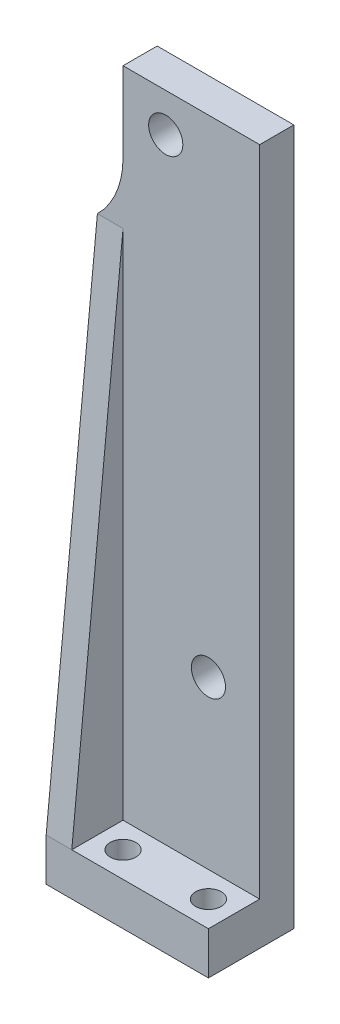
ISO-10303-21;
HEADER;
FILE_DESCRIPTION(('STEP AP214'),'2;1');
FILE_NAME('part.step','',(''),(''),'','','');
FILE_SCHEMA(('AUTOMOTIVE_DESIGN { 1 0 10303 214 1 1 1 1 }'));
ENDSEC;
DATA;
#1=APPLICATION_CONTEXT('core data for automotive mechanical design processes');
#2=APPLICATION_PROTOCOL_DEFINITION('international standard','automotive_design',2000,#1);
#3=PRODUCT_CONTEXT('',#1,'mechanical');
#4=PRODUCT('Part','Part','',(#3));
#5=PRODUCT_RELATED_PRODUCT_CATEGORY('part','',(#4));
#6=PRODUCT_DEFINITION_FORMATION('','',#4);
#7=PRODUCT_DEFINITION_CONTEXT('part definition',#1,'design');
#8=PRODUCT_DEFINITION('design','',#6,#7);
#9=PRODUCT_DEFINITION_SHAPE('','',#8);
#10=(LENGTH_UNIT() NAMED_UNIT(*) SI_UNIT(.MILLI.,.METRE.));
#11=(NAMED_UNIT(*) PLANE_ANGLE_UNIT() SI_UNIT($,.RADIAN.));
#12=(NAMED_UNIT(*) SI_UNIT($,.STERADIAN.) SOLID_ANGLE_UNIT());
#13=UNCERTAINTY_MEASURE_WITH_UNIT(LENGTH_MEASURE(1.E-05),#10,'distance_accuracy_value','');
#14=(GEOMETRIC_REPRESENTATION_CONTEXT(3) GLOBAL_UNCERTAINTY_ASSIGNED_CONTEXT((#13)) GLOBAL_UNIT_ASSIGNED_CONTEXT((#10,
#11,#12)) REPRESENTATION_CONTEXT('',''));
#15=CARTESIAN_POINT('',(0.,0.,0.));
#16=DIRECTION('',(0.,0.,1.));
#17=DIRECTION('',(1.,0.,0.));
#18=AXIS2_PLACEMENT_3D('',#15,#16,#17);
#19=CARTESIAN_POINT('',(-10.,5.,0.));
#20=DIRECTION('',(1.,0.,0.));
#21=DIRECTION('',(0.,0.,-1.));
#22=AXIS2_PLACEMENT_3D('',#19,#20,#21);
#23=PLANE('',#22);
#24=DIRECTION('',(0.,-1.,0.));
#25=VECTOR('',#24,1.);
#26=CARTESIAN_POINT('',(-9.99999999999999,81.5,-7.));
#27=LINE('',#26,#25);
#28=CARTESIAN_POINT('',(-9.99999999999999,81.5,-7.));
#29=VERTEX_POINT('',#28);
#30=CARTESIAN_POINT('',(-9.99999999999999,72.1414284285429,-7.));
#31=VERTEX_POINT('',#30);
#32=EDGE_CURVE('E157',#29,#31,#27,.T.);
#33=ORIENTED_EDGE('',*,*,#32,.T.);
#34=DIRECTION('',(0.,0.,-1.));
#35=VECTOR('',#34,1.);
#36=CARTESIAN_POINT('',(-10.,72.1414284285429,0.));
#37=LINE('',#36,#35);
#38=CARTESIAN_POINT('',(-9.99999999999999,72.1414284285429,-3.));
#39=VERTEX_POINT('',#38);
#40=EDGE_CURVE('E113',#31,#39,#37,.F.);
#41=ORIENTED_EDGE('',*,*,#40,.T.);
#42=DIRECTION('',(0.,-1.,0.));
#43=VECTOR('',#42,1.);
#44=CARTESIAN_POINT('',(-9.99999999999999,81.5,-3.));
#45=LINE('',#44,#43);
#46=CARTESIAN_POINT('',(-9.99999999999999,81.5,-3.));
#47=VERTEX_POINT('',#46);
#48=EDGE_CURVE('E151',#47,#39,#45,.T.);
#49=ORIENTED_EDGE('',*,*,#48,.F.);
#50=DIRECTION('',(0.,0.,1.));
#51=VECTOR('',#50,1.);
#52=CARTESIAN_POINT('',(-9.99999999999999,81.5,-7.));
#53=LINE('',#52,#51);
#54=EDGE_CURVE('E169',#29,#47,#53,.T.);
#55=ORIENTED_EDGE('',*,*,#54,.F.);
#56=EDGE_LOOP('',(#33,#41,#49,#55));
#57=FACE_BOUND('',#56,.T.);
#58=ADVANCED_FACE('F38',(#57),#23,.F.);
#59=CARTESIAN_POINT('',(-5.,77.,3.));
#60=DIRECTION('',(0.,0.,-1.));
#61=DIRECTION('',(-1.,0.,0.));
#62=AXIS2_PLACEMENT_3D('',#59,#60,#61);
#63=CYLINDRICAL_SURFACE('',#62,2.);
#64=CARTESIAN_POINT('',(-5.,77.,-3.));
#65=DIRECTION('',(0.,0.,1.));
#66=DIRECTION('',(1.,0.,0.));
#67=AXIS2_PLACEMENT_3D('',#64,#65,#66);
#68=CIRCLE('',#67,2.);
#69=CARTESIAN_POINT('',(-3.,77.,-3.));
#70=VERTEX_POINT('',#69);
#71=EDGE_CURVE('E163',#70,#70,#68,.T.);
#72=ORIENTED_EDGE('',*,*,#71,.T.);
#73=EDGE_LOOP('',(#72));
#74=FACE_BOUND('',#73,.T.);
#75=CARTESIAN_POINT('',(-5.,77.,-6.));
#76=DIRECTION('',(0.,0.,-1.));
#77=DIRECTION('',(-1.,0.,0.));
#78=AXIS2_PLACEMENT_3D('',#75,#76,#77);
#79=CIRCLE('',#78,2.);
#80=CARTESIAN_POINT('',(-7.,77.,-6.));
#81=VERTEX_POINT('',#80);
#82=EDGE_CURVE('E142',#81,#81,#79,.F.);
#83=ORIENTED_EDGE('',*,*,#82,.F.);
#84=EDGE_LOOP('',(#83));
#85=FACE_BOUND('',#84,.T.);
#86=ADVANCED_FACE('F238',(#74,#85),#63,.F.);
#87=CARTESIAN_POINT('',(0.,5.,3.));
#88=DIRECTION('',(0.,0.,-1.));
#89=DIRECTION('',(-1.,0.,0.));
#90=AXIS2_PLACEMENT_3D('',#87,#88,#89);
#91=PLANE('',#90);
#92=DIRECTION('',(1.,0.,0.));
#93=VECTOR('',#92,1.);
#94=CARTESIAN_POINT('',(0.,0.,3.));
#95=LINE('',#94,#93);
#96=CARTESIAN_POINT('',(-13.,0.,3.));
#97=VERTEX_POINT('',#96);
#98=CARTESIAN_POINT('',(6.,0.,3.));
#99=VERTEX_POINT('',#98);
#100=EDGE_CURVE('E197',#97,#99,#95,.T.);
#101=ORIENTED_EDGE('',*,*,#100,.T.);
#102=DIRECTION('',(0.,-1.,0.));
#103=VECTOR('',#102,1.);
#104=CARTESIAN_POINT('',(6.,5.,3.));
#105=LINE('',#104,#103);
#106=CARTESIAN_POINT('',(6.,5.,3.));
#107=VERTEX_POINT('',#106);
#108=EDGE_CURVE('E191',#107,#99,#105,.T.);
#109=ORIENTED_EDGE('',*,*,#108,.F.);
#110=DIRECTION('',(1.,0.,0.));
#111=VECTOR('',#110,1.);
#112=CARTESIAN_POINT('',(0.,5.,3.));
#113=LINE('',#112,#111);
#114=CARTESIAN_POINT('',(-10.,5.,3.));
#115=VERTEX_POINT('',#114);
#116=EDGE_CURVE('E181',#115,#107,#113,.T.);
#117=ORIENTED_EDGE('',*,*,#116,.F.);
#118=DIRECTION('',(1.,0.,0.));
#119=VECTOR('',#118,1.);
#120=CARTESIAN_POINT('',(-13.,5.,3.));
#121=LINE('',#120,#119);
#122=CARTESIAN_POINT('',(-13.,5.,3.));
#123=VERTEX_POINT('',#122);
#124=EDGE_CURVE('E132',#123,#115,#121,.T.);
#125=ORIENTED_EDGE('',*,*,#124,.F.);
#126=DIRECTION('',(0.,1.,0.));
#127=VECTOR('',#126,1.);
#128=CARTESIAN_POINT('',(-13.,0.,3.));
#129=LINE('',#128,#127);
#130=EDGE_CURVE('E127',#97,#123,#129,.T.);
#131=ORIENTED_EDGE('',*,*,#130,.F.);
#132=EDGE_LOOP('',(#101,#109,#117,#125,#131));
#133=FACE_BOUND('',#132,.T.);
#134=ADVANCED_FACE('F236',(#133),#91,.F.);
#135=CARTESIAN_POINT('',(6.,5.,0.));
#136=DIRECTION('',(1.,0.,0.));
#137=DIRECTION('',(0.,0.,-1.));
#138=AXIS2_PLACEMENT_3D('',#135,#136,#137);
#139=PLANE('',#138);
#140=DIRECTION('',(0.,0.,1.));
#141=VECTOR('',#140,1.);
#142=CARTESIAN_POINT('',(6.,0.,0.));
#143=LINE('',#142,#141);
#144=CARTESIAN_POINT('',(6.,0.,-7.));
#145=VERTEX_POINT('',#144);
#146=EDGE_CURVE('E178',#145,#99,#143,.T.);
#147=ORIENTED_EDGE('',*,*,#146,.F.);
#148=DIRECTION('',(0.,1.,0.));
#149=VECTOR('',#148,1.);
#150=CARTESIAN_POINT('',(6.,0.,-7.));
#151=LINE('',#150,#149);
#152=CARTESIAN_POINT('',(6.,81.5,-7.));
#153=VERTEX_POINT('',#152);
#154=EDGE_CURVE('E150',#145,#153,#151,.T.);
#155=ORIENTED_EDGE('',*,*,#154,.T.);
#156=DIRECTION('',(0.,0.,1.));
#157=VECTOR('',#156,1.);
#158=CARTESIAN_POINT('',(6.,81.5,-7.));
#159=LINE('',#158,#157);
#160=CARTESIAN_POINT('',(6.,81.5,-3.));
#161=VERTEX_POINT('',#160);
#162=EDGE_CURVE('E159',#153,#161,#159,.T.);
#163=ORIENTED_EDGE('',*,*,#162,.T.);
#164=DIRECTION('',(0.,1.,0.));
#165=VECTOR('',#164,1.);
#166=CARTESIAN_POINT('',(6.,0.,-3.));
#167=LINE('',#166,#165);
#168=CARTESIAN_POINT('',(6.,5.,-3.));
#169=VERTEX_POINT('',#168);
#170=EDGE_CURVE('E160',#169,#161,#167,.T.);
#171=ORIENTED_EDGE('',*,*,#170,.F.);
#172=DIRECTION('',(0.,0.,1.));
#173=VECTOR('',#172,1.);
#174=CARTESIAN_POINT('',(6.,5.,0.));
#175=LINE('',#174,#173);
#176=EDGE_CURVE('E183',#169,#107,#175,.T.);
#177=ORIENTED_EDGE('',*,*,#176,.T.);
#178=ORIENTED_EDGE('',*,*,#108,.T.);
#179=EDGE_LOOP('',(#147,#155,#163,#171,#177,#178));
#180=FACE_BOUND('',#179,.T.);
#181=ADVANCED_FACE('F227',(#180),#139,.T.);
#182=CARTESIAN_POINT('',(-7.,5.,0.));
#183=DIRECTION('',(0.,-1.,0.));
#184=DIRECTION('',(0.,0.,-1.));
#185=AXIS2_PLACEMENT_3D('',#182,#183,#184);
#186=CYLINDRICAL_SURFACE('',#185,1.5);
#187=CARTESIAN_POINT('',(-7.,5.,0.));
#188=DIRECTION('',(0.,1.,0.));
#189=DIRECTION('',(0.,0.,1.));
#190=AXIS2_PLACEMENT_3D('',#187,#188,#189);
#191=CIRCLE('',#190,1.5);
#192=CARTESIAN_POINT('',(-7.,5.,1.5));
#193=VERTEX_POINT('',#192);
#194=EDGE_CURVE('E177',#193,#193,#191,.T.);
#195=ORIENTED_EDGE('',*,*,#194,.T.);
#196=EDGE_LOOP('',(#195));
#197=FACE_BOUND('',#196,.T.);
#198=CARTESIAN_POINT('',(-7.,0.,0.));
#199=DIRECTION('',(0.,1.,0.));
#200=DIRECTION('',(0.,0.,1.));
#201=AXIS2_PLACEMENT_3D('',#198,#199,#200);
#202=CIRCLE('',#201,1.5);
#203=CARTESIAN_POINT('',(-7.,0.,1.5));
#204=VERTEX_POINT('',#203);
#205=EDGE_CURVE('E194',#204,#204,#202,.T.);
#206=ORIENTED_EDGE('',*,*,#205,.F.);
#207=EDGE_LOOP('',(#206));
#208=FACE_BOUND('',#207,.T.);
#209=ADVANCED_FACE('F244',(#197,#208),#186,.F.);
#210=CARTESIAN_POINT('',(3.,5.,0.));
#211=DIRECTION('',(0.,-1.,0.));
#212=DIRECTION('',(0.,0.,-1.));
#213=AXIS2_PLACEMENT_3D('',#210,#211,#212);
#214=CYLINDRICAL_SURFACE('',#213,1.5);
#215=CARTESIAN_POINT('',(3.,5.,0.));
#216=DIRECTION('',(0.,1.,0.));
#217=DIRECTION('',(0.,0.,1.));
#218=AXIS2_PLACEMENT_3D('',#215,#216,#217);
#219=CIRCLE('',#218,1.5);
#220=CARTESIAN_POINT('',(3.,5.,1.5));
#221=VERTEX_POINT('',#220);
#222=EDGE_CURVE('E174',#221,#221,#219,.T.);
#223=ORIENTED_EDGE('',*,*,#222,.T.);
#224=EDGE_LOOP('',(#223));
#225=FACE_BOUND('',#224,.T.);
#226=CARTESIAN_POINT('',(3.,0.,0.));
#227=DIRECTION('',(0.,1.,0.));
#228=DIRECTION('',(0.,0.,1.));
#229=AXIS2_PLACEMENT_3D('',#226,#227,#228);
#230=CIRCLE('',#229,1.5);
#231=CARTESIAN_POINT('',(3.,0.,1.5));
#232=VERTEX_POINT('',#231);
#233=EDGE_CURVE('E171',#232,#232,#230,.T.);
#234=ORIENTED_EDGE('',*,*,#233,.F.);
#235=EDGE_LOOP('',(#234));
#236=FACE_BOUND('',#235,.T.);
#237=ADVANCED_FACE('F260',(#225,#236),#214,.F.);
#238=CARTESIAN_POINT('',(0.,5.,0.));
#239=DIRECTION('',(0.,1.,0.));
#240=DIRECTION('',(0.,0.,1.));
#241=AXIS2_PLACEMENT_3D('',#238,#239,#240);
#242=PLANE('',#241);
#243=ORIENTED_EDGE('',*,*,#222,.F.);
#244=EDGE_LOOP('',(#243));
#245=FACE_BOUND('',#244,.T.);
#246=ORIENTED_EDGE('',*,*,#194,.F.);
#247=EDGE_LOOP('',(#246));
#248=FACE_BOUND('',#247,.T.);
#249=ORIENTED_EDGE('',*,*,#116,.T.);
#250=ORIENTED_EDGE('',*,*,#176,.F.);
#251=DIRECTION('',(1.,0.,0.));
#252=VECTOR('',#251,1.);
#253=CARTESIAN_POINT('',(0.,5.,-3.));
#254=LINE('',#253,#252);
#255=CARTESIAN_POINT('',(-10.,5.,-3.));
#256=VERTEX_POINT('',#255);
#257=EDGE_CURVE('E186',#256,#169,#254,.T.);
#258=ORIENTED_EDGE('',*,*,#257,.F.);
#259=DIRECTION('',(0.,0.,1.));
#260=VECTOR('',#259,1.);
#261=CARTESIAN_POINT('',(-10.,5.,0.));
#262=LINE('',#261,#260);
#263=EDGE_CURVE('E189',#256,#115,#262,.T.);
#264=ORIENTED_EDGE('',*,*,#263,.T.);
#265=EDGE_LOOP('',(#249,#250,#258,#264));
#266=FACE_BOUND('',#265,.T.);
#267=ADVANCED_FACE('F223',(#245,#248,#266),#242,.T.);
#268=CARTESIAN_POINT('',(0.,0.,0.));
#269=DIRECTION('',(0.,1.,0.));
#270=DIRECTION('',(0.,0.,1.));
#271=AXIS2_PLACEMENT_3D('',#268,#269,#270);
#272=PLANE('',#271);
#273=ORIENTED_EDGE('',*,*,#233,.T.);
#274=EDGE_LOOP('',(#273));
#275=FACE_BOUND('',#274,.T.);
#276=ORIENTED_EDGE('',*,*,#205,.T.);
#277=EDGE_LOOP('',(#276));
#278=FACE_BOUND('',#277,.T.);
#279=ORIENTED_EDGE('',*,*,#100,.F.);
#280=DIRECTION('',(0.,0.,1.));
#281=VECTOR('',#280,1.);
#282=CARTESIAN_POINT('',(-13.,0.,0.));
#283=LINE('',#282,#281);
#284=CARTESIAN_POINT('',(-13.,0.,-7.));
#285=VERTEX_POINT('',#284);
#286=EDGE_CURVE('E125',#285,#97,#283,.T.);
#287=ORIENTED_EDGE('',*,*,#286,.F.);
#288=DIRECTION('',(1.,0.,0.));
#289=VECTOR('',#288,1.);
#290=CARTESIAN_POINT('',(-10.,0.,-7.));
#291=LINE('',#290,#289);
#292=EDGE_CURVE('E124',#285,#145,#291,.T.);
#293=ORIENTED_EDGE('',*,*,#292,.T.);
#294=ORIENTED_EDGE('',*,*,#146,.T.);
#295=EDGE_LOOP('',(#279,#287,#293,#294));
#296=FACE_BOUND('',#295,.T.);
#297=ADVANCED_FACE('F233',(#275,#278,#296),#272,.F.);
#298=CARTESIAN_POINT('',(6.,81.5,-7.));
#299=DIRECTION('',(0.,1.,0.));
#300=DIRECTION('',(0.,0.,1.));
#301=AXIS2_PLACEMENT_3D('',#298,#299,#300);
#302=PLANE('',#301);
#303=DIRECTION('',(-1.,0.,0.));
#304=VECTOR('',#303,1.);
#305=CARTESIAN_POINT('',(6.,81.5,-3.));
#306=LINE('',#305,#304);
#307=EDGE_CURVE('E162',#161,#47,#306,.T.);
#308=ORIENTED_EDGE('',*,*,#307,.F.);
#309=ORIENTED_EDGE('',*,*,#162,.F.);
#310=DIRECTION('',(-1.,0.,0.));
#311=VECTOR('',#310,1.);
#312=CARTESIAN_POINT('',(6.,81.5,-7.));
#313=LINE('',#312,#311);
#314=EDGE_CURVE('E154',#153,#29,#313,.T.);
#315=ORIENTED_EDGE('',*,*,#314,.T.);
#316=ORIENTED_EDGE('',*,*,#54,.T.);
#317=EDGE_LOOP('',(#308,#309,#315,#316));
#318=FACE_BOUND('',#317,.T.);
#319=ADVANCED_FACE('F256',(#318),#302,.T.);
#320=CARTESIAN_POINT('',(0.,0.,-7.));
#321=DIRECTION('',(0.,0.,1.));
#322=DIRECTION('',(1.,0.,0.));
#323=AXIS2_PLACEMENT_3D('',#320,#321,#322);
#324=PLANE('',#323);
#325=CARTESIAN_POINT('',(-5.,77.,-7.));
#326=DIRECTION('',(0.,0.,-1.));
#327=DIRECTION('',(-1.,0.,0.));
#328=AXIS2_PLACEMENT_3D('',#325,#326,#327);
#329=CIRCLE('',#328,3.5);
#330=CARTESIAN_POINT('',(-8.5,77.,-7.));
#331=VERTEX_POINT('',#330);
#332=EDGE_CURVE('E138',#331,#331,#329,.T.);
#333=ORIENTED_EDGE('',*,*,#332,.F.);
#334=EDGE_LOOP('',(#333));
#335=FACE_BOUND('',#334,.T.);
#336=CARTESIAN_POINT('',(0.,24.5,-7.));
#337=DIRECTION('',(0.,0.,-1.));
#338=DIRECTION('',(-1.,0.,0.));
#339=AXIS2_PLACEMENT_3D('',#336,#337,#338);
#340=CIRCLE('',#339,2.);
#341=CARTESIAN_POINT('',(-2.,24.5,-7.));
#342=VERTEX_POINT('',#341);
#343=EDGE_CURVE('E145',#342,#342,#340,.T.);
#344=ORIENTED_EDGE('',*,*,#343,.F.);
#345=EDGE_LOOP('',(#344));
#346=FACE_BOUND('',#345,.T.);
#347=ORIENTED_EDGE('',*,*,#292,.F.);
#348=DIRECTION('',(0.,-1.,0.));
#349=VECTOR('',#348,1.);
#350=CARTESIAN_POINT('',(-13.,0.,-7.));
#351=LINE('',#350,#349);
#352=CARTESIAN_POINT('',(-13.,65.,-7.));
#353=VERTEX_POINT('',#352);
#354=EDGE_CURVE('E118',#353,#285,#351,.T.);
#355=ORIENTED_EDGE('',*,*,#354,.F.);
#356=CARTESIAN_POINT('',(-20.,72.1414284285429,-7.));
#357=DIRECTION('',(0.,0.,1.));
#358=DIRECTION('',(1.,0.,0.));
#359=AXIS2_PLACEMENT_3D('',#356,#357,#358);
#360=CIRCLE('',#359,10.);
#361=EDGE_CURVE('E61',#353,#31,#360,.T.);
#362=ORIENTED_EDGE('',*,*,#361,.T.);
#363=ORIENTED_EDGE('',*,*,#32,.F.);
#364=ORIENTED_EDGE('',*,*,#314,.F.);
#365=ORIENTED_EDGE('',*,*,#154,.F.);
#366=EDGE_LOOP('',(#347,#355,#362,#363,#364,#365));
#367=FACE_BOUND('',#366,.T.);
#368=ADVANCED_FACE('F121',(#335,#346,#367),#324,.F.);
#369=CARTESIAN_POINT('',(0.,0.,-3.));
#370=DIRECTION('',(0.,0.,1.));
#371=DIRECTION('',(1.,0.,0.));
#372=AXIS2_PLACEMENT_3D('',#369,#370,#371);
#373=PLANE('',#372);
#374=CARTESIAN_POINT('',(0.,24.5,-3.));
#375=DIRECTION('',(0.,0.,1.));
#376=DIRECTION('',(1.,0.,0.));
#377=AXIS2_PLACEMENT_3D('',#374,#375,#376);
#378=CIRCLE('',#377,2.);
#379=CARTESIAN_POINT('',(2.,24.5,-3.));
#380=VERTEX_POINT('',#379);
#381=EDGE_CURVE('E148',#380,#380,#378,.T.);
#382=ORIENTED_EDGE('',*,*,#381,.F.);
#383=EDGE_LOOP('',(#382));
#384=FACE_BOUND('',#383,.T.);
#385=ORIENTED_EDGE('',*,*,#71,.F.);
#386=EDGE_LOOP('',(#385));
#387=FACE_BOUND('',#386,.T.);
#388=ORIENTED_EDGE('',*,*,#48,.T.);
#389=CARTESIAN_POINT('',(-20.,72.1414284285429,-3.));
#390=DIRECTION('',(0.,0.,1.));
#391=DIRECTION('',(1.,0.,0.));
#392=AXIS2_PLACEMENT_3D('',#389,#390,#391);
#393=CIRCLE('',#392,10.);
#394=CARTESIAN_POINT('',(-13.,65.,-3.));
#395=VERTEX_POINT('',#394);
#396=EDGE_CURVE('E46',#39,#395,#393,.F.);
#397=ORIENTED_EDGE('',*,*,#396,.T.);
#398=DIRECTION('',(-1.,0.,0.));
#399=VECTOR('',#398,1.);
#400=CARTESIAN_POINT('',(-12.9999999999998,65.,-3.));
#401=LINE('',#400,#399);
#402=CARTESIAN_POINT('',(-9.99999999999999,65.,-3.));
#403=VERTEX_POINT('',#402);
#404=EDGE_CURVE('E11',#403,#395,#401,.T.);
#405=ORIENTED_EDGE('',*,*,#404,.F.);
#406=EDGE_CURVE('E166',#403,#256,#45,.T.);
#407=ORIENTED_EDGE('',*,*,#406,.T.);
#408=ORIENTED_EDGE('',*,*,#257,.T.);
#409=ORIENTED_EDGE('',*,*,#170,.T.);
#410=ORIENTED_EDGE('',*,*,#307,.T.);
#411=EDGE_LOOP('',(#388,#397,#405,#407,#408,#409,#410));
#412=FACE_BOUND('',#411,.T.);
#413=ADVANCED_FACE('F210',(#384,#387,#412),#373,.T.);
#414=CARTESIAN_POINT('',(0.,24.5,3.));
#415=DIRECTION('',(0.,0.,-1.));
#416=DIRECTION('',(-1.,0.,0.));
#417=AXIS2_PLACEMENT_3D('',#414,#415,#416);
#418=CYLINDRICAL_SURFACE('',#417,2.);
#419=ORIENTED_EDGE('',*,*,#381,.T.);
#420=EDGE_LOOP('',(#419));
#421=FACE_BOUND('',#420,.T.);
#422=ORIENTED_EDGE('',*,*,#343,.T.);
#423=EDGE_LOOP('',(#422));
#424=FACE_BOUND('',#423,.T.);
#425=ADVANCED_FACE('F266',(#421,#424),#418,.F.);
#426=CARTESIAN_POINT('',(-5.,77.,-6.));
#427=DIRECTION('',(0.,0.,-1.));
#428=DIRECTION('',(-1.,0.,0.));
#429=AXIS2_PLACEMENT_3D('',#426,#427,#428);
#430=PLANE('',#429);
#431=CARTESIAN_POINT('',(-5.,77.,-6.));
#432=DIRECTION('',(0.,0.,-1.));
#433=DIRECTION('',(-1.,0.,0.));
#434=AXIS2_PLACEMENT_3D('',#431,#432,#433);
#435=CIRCLE('',#434,3.5);
#436=CARTESIAN_POINT('',(-8.5,77.,-6.));
#437=VERTEX_POINT('',#436);
#438=EDGE_CURVE('E139',#437,#437,#435,.T.);
#439=ORIENTED_EDGE('',*,*,#438,.T.);
#440=EDGE_LOOP('',(#439));
#441=FACE_BOUND('',#440,.T.);
#442=ORIENTED_EDGE('',*,*,#82,.T.);
#443=EDGE_LOOP('',(#442));
#444=FACE_BOUND('',#443,.T.);
#445=ADVANCED_FACE('F273',(#441,#444),#430,.T.);
#446=CARTESIAN_POINT('',(-5.,77.,-6.));
#447=DIRECTION('',(0.,0.,-1.));
#448=DIRECTION('',(-1.,0.,0.));
#449=AXIS2_PLACEMENT_3D('',#446,#447,#448);
#450=CYLINDRICAL_SURFACE('',#449,3.5);
#451=ORIENTED_EDGE('',*,*,#438,.F.);
#452=EDGE_LOOP('',(#451));
#453=FACE_BOUND('',#452,.T.);
#454=ORIENTED_EDGE('',*,*,#332,.T.);
#455=EDGE_LOOP('',(#454));
#456=FACE_BOUND('',#455,.T.);
#457=ADVANCED_FACE('F275',(#453,#456),#450,.F.);
#458=CARTESIAN_POINT('',(-13.,0.346534653465347,3.46534653465347));
#459=DIRECTION('',(0.,-0.099503719020999,-0.995037190209989));
#460=DIRECTION('',(0.,0.995037190209989,-0.099503719020999));
#461=AXIS2_PLACEMENT_3D('',#458,#459,#460);
#462=PLANE('',#461);
#463=DIRECTION('',(0.,0.995037190209989,-0.099503719020999));
#464=VECTOR('',#463,1.);
#465=CARTESIAN_POINT('',(-10.,0.346534653465347,3.46534653465347));
#466=LINE('',#465,#464);
#467=EDGE_CURVE('E133',#115,#403,#466,.T.);
#468=ORIENTED_EDGE('',*,*,#467,.T.);
#469=ORIENTED_EDGE('',*,*,#404,.T.);
#470=DIRECTION('',(0.,0.995037190209989,-0.099503719020999));
#471=VECTOR('',#470,1.);
#472=CARTESIAN_POINT('',(-13.,0.346534653465347,3.46534653465347));
#473=LINE('',#472,#471);
#474=EDGE_CURVE('E53',#123,#395,#473,.T.);
#475=ORIENTED_EDGE('',*,*,#474,.F.);
#476=ORIENTED_EDGE('',*,*,#124,.T.);
#477=EDGE_LOOP('',(#468,#469,#475,#476));
#478=FACE_BOUND('',#477,.T.);
#479=ADVANCED_FACE('F214',(#478),#462,.F.);
#480=CARTESIAN_POINT('',(-13.,0.,0.));
#481=DIRECTION('',(-1.,0.,0.));
#482=DIRECTION('',(0.,0.,1.));
#483=AXIS2_PLACEMENT_3D('',#480,#481,#482);
#484=PLANE('',#483);
#485=ORIENTED_EDGE('',*,*,#474,.T.);
#486=DIRECTION('',(0.,0.,-1.));
#487=VECTOR('',#486,1.);
#488=CARTESIAN_POINT('',(-13.,65.,0.));
#489=LINE('',#488,#487);
#490=EDGE_CURVE('E112',#395,#353,#489,.T.);
#491=ORIENTED_EDGE('',*,*,#490,.T.);
#492=ORIENTED_EDGE('',*,*,#354,.T.);
#493=ORIENTED_EDGE('',*,*,#286,.T.);
#494=ORIENTED_EDGE('',*,*,#130,.T.);
#495=EDGE_LOOP('',(#485,#491,#492,#493,#494));
#496=FACE_BOUND('',#495,.T.);
#497=ADVANCED_FACE('F116',(#496),#484,.T.);
#498=CARTESIAN_POINT('',(-10.,0.,0.));
#499=DIRECTION('',(-1.,0.,0.));
#500=DIRECTION('',(0.,0.,1.));
#501=AXIS2_PLACEMENT_3D('',#498,#499,#500);
#502=PLANE('',#501);
#503=ORIENTED_EDGE('',*,*,#263,.F.);
#504=ORIENTED_EDGE('',*,*,#406,.F.);
#505=ORIENTED_EDGE('',*,*,#467,.F.);
#506=EDGE_LOOP('',(#503,#504,#505));
#507=FACE_BOUND('',#506,.T.);
#508=ADVANCED_FACE('F219',(#507),#502,.F.);
#509=CARTESIAN_POINT('',(-20.,72.1414284285429,0.));
#510=DIRECTION('',(0.,0.,-1.));
#511=DIRECTION('',(-1.,0.,0.));
#512=AXIS2_PLACEMENT_3D('',#509,#510,#511);
#513=CYLINDRICAL_SURFACE('',#512,10.);
#514=ORIENTED_EDGE('',*,*,#396,.F.);
#515=ORIENTED_EDGE('',*,*,#40,.F.);
#516=ORIENTED_EDGE('',*,*,#361,.F.);
#517=ORIENTED_EDGE('',*,*,#490,.F.);
#518=EDGE_LOOP('',(#514,#515,#516,#517));
#519=FACE_BOUND('',#518,.T.);
#520=ADVANCED_FACE('F40',(#519),#513,.F.);
#521=CLOSED_SHELL('',(#58,#86,#134,#181,#209,#237,#267,#297,#319,#368,#413,#425,#445,#457,#479,
#497,#508,#520));
#522=MANIFOLD_SOLID_BREP('B2',#521);
#523=ADVANCED_BREP_SHAPE_REPRESENTATION('',(#18,#522),#14);
#524=SHAPE_DEFINITION_REPRESENTATION(#9,#523);
ENDSEC;
END-ISO-10303-21;
